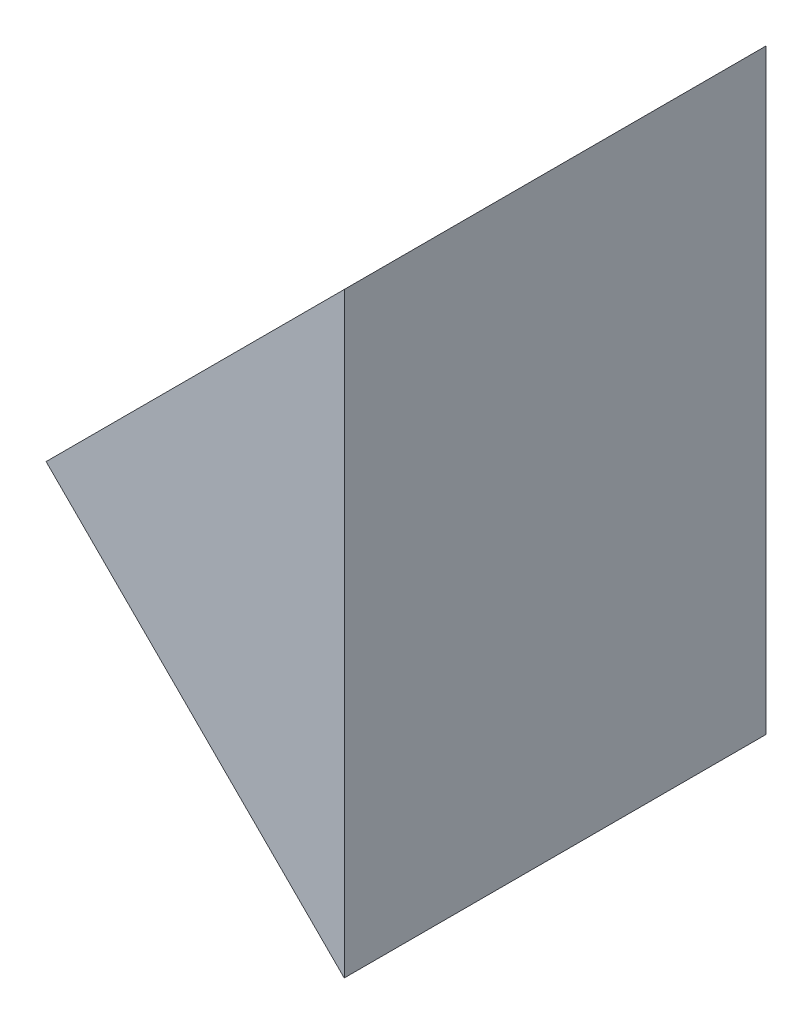
ISO-10303-21;
HEADER;
FILE_DESCRIPTION(('STEP AP214'),'2;1');
FILE_NAME('part.step','',(''),(''),'','','');
FILE_SCHEMA(('AUTOMOTIVE_DESIGN { 1 0 10303 214 1 1 1 1 }'));
ENDSEC;
DATA;
#1=APPLICATION_CONTEXT('core data for automotive mechanical design processes');
#2=APPLICATION_PROTOCOL_DEFINITION('international standard','automotive_design',2000,#1);
#3=PRODUCT_CONTEXT('',#1,'mechanical');
#4=PRODUCT('Part','Part','',(#3));
#5=PRODUCT_RELATED_PRODUCT_CATEGORY('part','',(#4));
#6=PRODUCT_DEFINITION_FORMATION('','',#4);
#7=PRODUCT_DEFINITION_CONTEXT('part definition',#1,'design');
#8=PRODUCT_DEFINITION('design','',#6,#7);
#9=PRODUCT_DEFINITION_SHAPE('','',#8);
#10=(LENGTH_UNIT() NAMED_UNIT(*) SI_UNIT(.MILLI.,.METRE.));
#11=(NAMED_UNIT(*) PLANE_ANGLE_UNIT() SI_UNIT($,.RADIAN.));
#12=(NAMED_UNIT(*) SI_UNIT($,.STERADIAN.) SOLID_ANGLE_UNIT());
#13=UNCERTAINTY_MEASURE_WITH_UNIT(LENGTH_MEASURE(1.E-05),#10,'distance_accuracy_value','');
#14=(GEOMETRIC_REPRESENTATION_CONTEXT(3) GLOBAL_UNCERTAINTY_ASSIGNED_CONTEXT((#13)) GLOBAL_UNIT_ASSIGNED_CONTEXT((#10,
#11,#12)) REPRESENTATION_CONTEXT('',''));
#15=CARTESIAN_POINT('',(0.,0.,0.));
#16=DIRECTION('',(0.,0.,1.));
#17=DIRECTION('',(1.,0.,0.));
#18=AXIS2_PLACEMENT_3D('',#15,#16,#17);
#19=CARTESIAN_POINT('',(138.691674881487,34.4392313820852,12.5));
#20=DIRECTION('',(0.707106781186548,0.707106781186547,0.));
#21=DIRECTION('',(-0.707106781186547,0.707106781186548,0.));
#22=AXIS2_PLACEMENT_3D('',#19,#20,#21);
#23=PLANE('',#22);
#24=DIRECTION('',(0.707106781186547,-0.707106781186549,0.));
#25=VECTOR('',#24,1.);
#26=CARTESIAN_POINT('',(138.691674881487,34.4392313820852,0.));
#27=LINE('',#26,#25);
#28=CARTESIAN_POINT('',(138.691674881487,34.4392313820852,0.));
#29=VERTEX_POINT('',#28);
#30=CARTESIAN_POINT('',(147.530509646319,25.6003966172533,0.));
#31=VERTEX_POINT('',#30);
#32=EDGE_CURVE('E84',#29,#31,#27,.T.);
#33=ORIENTED_EDGE('',*,*,#32,.T.);
#34=DIRECTION('',(0.,0.,-1.));
#35=VECTOR('',#34,1.);
#36=CARTESIAN_POINT('',(147.530509646319,25.6003966172533,12.5));
#37=LINE('',#36,#35);
#38=CARTESIAN_POINT('',(147.530509646319,25.6003966172533,12.5));
#39=VERTEX_POINT('',#38);
#40=EDGE_CURVE('E11',#39,#31,#37,.T.);
#41=ORIENTED_EDGE('',*,*,#40,.F.);
#42=DIRECTION('',(0.707106781186547,-0.707106781186549,0.));
#43=VECTOR('',#42,1.);
#44=CARTESIAN_POINT('',(138.691674881487,34.4392313820852,12.5));
#45=LINE('',#44,#43);
#46=CARTESIAN_POINT('',(138.691674881487,34.4392313820852,12.5));
#47=VERTEX_POINT('',#46);
#48=EDGE_CURVE('E77',#47,#39,#45,.T.);
#49=ORIENTED_EDGE('',*,*,#48,.F.);
#50=DIRECTION('',(0.,0.,-1.));
#51=VECTOR('',#50,1.);
#52=CARTESIAN_POINT('',(138.691674881487,34.4392313820852,12.5));
#53=LINE('',#52,#51);
#54=EDGE_CURVE('E85',#47,#29,#53,.T.);
#55=ORIENTED_EDGE('',*,*,#54,.T.);
#56=EDGE_LOOP('',(#33,#41,#49,#55));
#57=FACE_BOUND('',#56,.T.);
#58=ADVANCED_FACE('F37',(#57),#23,.F.);
#59=CARTESIAN_POINT('',(147.530509646319,25.6003966172533,12.5));
#60=DIRECTION('',(-1.,0.,0.));
#61=DIRECTION('',(0.,-1.,0.));
#62=AXIS2_PLACEMENT_3D('',#59,#60,#61);
#63=PLANE('',#62);
#64=DIRECTION('',(0.,1.,0.));
#65=VECTOR('',#64,1.);
#66=CARTESIAN_POINT('',(147.530509646319,25.6003966172533,0.));
#67=LINE('',#66,#65);
#68=CARTESIAN_POINT('',(147.530509646319,43.278066146917,0.));
#69=VERTEX_POINT('',#68);
#70=EDGE_CURVE('E65',#31,#69,#67,.T.);
#71=ORIENTED_EDGE('',*,*,#70,.T.);
#72=DIRECTION('',(0.,0.,-1.));
#73=VECTOR('',#72,1.);
#74=CARTESIAN_POINT('',(147.530509646319,43.278066146917,12.5));
#75=LINE('',#74,#73);
#76=CARTESIAN_POINT('',(147.530509646319,43.278066146917,12.5));
#77=VERTEX_POINT('',#76);
#78=EDGE_CURVE('E45',#77,#69,#75,.T.);
#79=ORIENTED_EDGE('',*,*,#78,.F.);
#80=DIRECTION('',(0.,1.,0.));
#81=VECTOR('',#80,1.);
#82=CARTESIAN_POINT('',(147.530509646319,25.6003966172533,12.5));
#83=LINE('',#82,#81);
#84=EDGE_CURVE('E73',#39,#77,#83,.T.);
#85=ORIENTED_EDGE('',*,*,#84,.F.);
#86=ORIENTED_EDGE('',*,*,#40,.T.);
#87=EDGE_LOOP('',(#71,#79,#85,#86));
#88=FACE_BOUND('',#87,.T.);
#89=ADVANCED_FACE('F74',(#88),#63,.F.);
#90=CARTESIAN_POINT('',(138.691674881487,34.4392313820852,12.5));
#91=DIRECTION('',(0.707106781186547,-0.707106781186548,0.));
#92=DIRECTION('',(0.707106781186548,0.707106781186547,0.));
#93=AXIS2_PLACEMENT_3D('',#90,#91,#92);
#94=PLANE('',#93);
#95=DIRECTION('',(-0.707106781186548,-0.707106781186547,0.));
#96=VECTOR('',#95,1.);
#97=CARTESIAN_POINT('',(138.691674881487,34.4392313820852,0.));
#98=LINE('',#97,#96);
#99=EDGE_CURVE('E70',#69,#29,#98,.T.);
#100=ORIENTED_EDGE('',*,*,#99,.T.);
#101=ORIENTED_EDGE('',*,*,#54,.F.);
#102=DIRECTION('',(-0.707106781186548,-0.707106781186547,0.));
#103=VECTOR('',#102,1.);
#104=CARTESIAN_POINT('',(138.691674881487,34.4392313820852,12.5));
#105=LINE('',#104,#103);
#106=EDGE_CURVE('E53',#77,#47,#105,.T.);
#107=ORIENTED_EDGE('',*,*,#106,.F.);
#108=ORIENTED_EDGE('',*,*,#78,.T.);
#109=EDGE_LOOP('',(#100,#101,#107,#108));
#110=FACE_BOUND('',#109,.T.);
#111=ADVANCED_FACE('F92',(#110),#94,.F.);
#112=CARTESIAN_POINT('',(0.,0.,12.5));
#113=DIRECTION('',(0.,0.,1.));
#114=DIRECTION('',(1.,0.,0.));
#115=AXIS2_PLACEMENT_3D('',#112,#113,#114);
#116=PLANE('',#115);
#117=ORIENTED_EDGE('',*,*,#48,.T.);
#118=ORIENTED_EDGE('',*,*,#84,.T.);
#119=ORIENTED_EDGE('',*,*,#106,.T.);
#120=EDGE_LOOP('',(#117,#118,#119));
#121=FACE_BOUND('',#120,.T.);
#122=ADVANCED_FACE('F80',(#121),#116,.T.);
#123=CARTESIAN_POINT('',(0.,0.,0.));
#124=DIRECTION('',(0.,0.,1.));
#125=DIRECTION('',(1.,0.,0.));
#126=AXIS2_PLACEMENT_3D('',#123,#124,#125);
#127=PLANE('',#126);
#128=ORIENTED_EDGE('',*,*,#32,.F.);
#129=ORIENTED_EDGE('',*,*,#99,.F.);
#130=ORIENTED_EDGE('',*,*,#70,.F.);
#131=EDGE_LOOP('',(#128,#129,#130));
#132=FACE_BOUND('',#131,.T.);
#133=ADVANCED_FACE('F93',(#132),#127,.F.);
#134=CLOSED_SHELL('',(#58,#89,#111,#122,#133));
#135=MANIFOLD_SOLID_BREP('B2',#134);
#136=ADVANCED_BREP_SHAPE_REPRESENTATION('',(#18,#135),#14);
#137=SHAPE_DEFINITION_REPRESENTATION(#9,#136);
ENDSEC;
END-ISO-10303-21;
